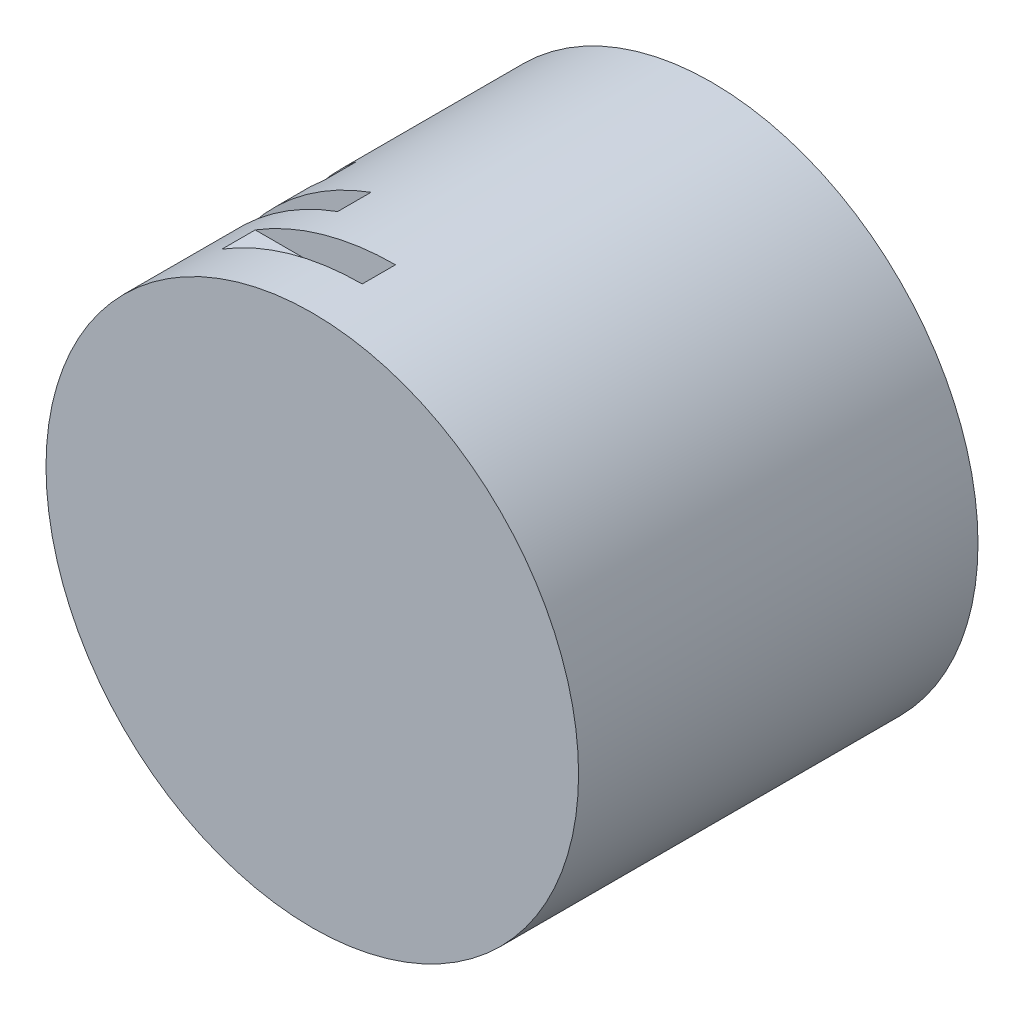
ISO-10303-21;
HEADER;
FILE_DESCRIPTION(('STEP AP214'),'2;1');
FILE_NAME('part.step','',(''),(''),'','','');
FILE_SCHEMA(('AUTOMOTIVE_DESIGN { 1 0 10303 214 1 1 1 1 }'));
ENDSEC;
DATA;
#1=APPLICATION_CONTEXT('core data for automotive mechanical design processes');
#2=APPLICATION_PROTOCOL_DEFINITION('international standard','automotive_design',2000,#1);
#3=PRODUCT_CONTEXT('',#1,'mechanical');
#4=PRODUCT('Part','Part','',(#3));
#5=PRODUCT_RELATED_PRODUCT_CATEGORY('part','',(#4));
#6=PRODUCT_DEFINITION_FORMATION('','',#4);
#7=PRODUCT_DEFINITION_CONTEXT('part definition',#1,'design');
#8=PRODUCT_DEFINITION('design','',#6,#7);
#9=PRODUCT_DEFINITION_SHAPE('','',#8);
#10=(LENGTH_UNIT() NAMED_UNIT(*) SI_UNIT(.MILLI.,.METRE.));
#11=(NAMED_UNIT(*) PLANE_ANGLE_UNIT() SI_UNIT($,.RADIAN.));
#12=(NAMED_UNIT(*) SI_UNIT($,.STERADIAN.) SOLID_ANGLE_UNIT());
#13=UNCERTAINTY_MEASURE_WITH_UNIT(LENGTH_MEASURE(1.E-05),#10,'distance_accuracy_value','');
#14=(GEOMETRIC_REPRESENTATION_CONTEXT(3) GLOBAL_UNCERTAINTY_ASSIGNED_CONTEXT((#13)) GLOBAL_UNIT_ASSIGNED_CONTEXT((#10,
#11,#12)) REPRESENTATION_CONTEXT('',''));
#15=CARTESIAN_POINT('',(0.,0.,0.));
#16=DIRECTION('',(0.,0.,1.));
#17=DIRECTION('',(1.,0.,0.));
#18=AXIS2_PLACEMENT_3D('',#15,#16,#17);
#19=CARTESIAN_POINT('',(0.,0.,300.));
#20=DIRECTION('',(0.,0.,-1.));
#21=DIRECTION('',(-1.,0.,0.));
#22=AXIS2_PLACEMENT_3D('',#19,#20,#21);
#23=CYLINDRICAL_SURFACE('',#22,400.);
#24=CARTESIAN_POINT('',(0.,0.,75.));
#25=DIRECTION('',(0.,0.,1.));
#26=DIRECTION('',(1.,0.,0.));
#27=AXIS2_PLACEMENT_3D('',#24,#25,#26);
#28=CIRCLE('',#27,400.);
#29=CARTESIAN_POINT('',(-136.808057330268,375.877048314363,75.));
#30=VERTEX_POINT('',#29);
#31=CARTESIAN_POINT('',(-314.292370464949,247.427374935602,75.));
#32=VERTEX_POINT('',#31);
#33=EDGE_CURVE('E134',#30,#32,#28,.T.);
#34=ORIENTED_EDGE('',*,*,#33,.F.);
#35=DIRECTION('',(0.,0.,1.));
#36=VECTOR('',#35,1.);
#37=CARTESIAN_POINT('',(-136.808057330268,375.877048314363,75.));
#38=LINE('',#37,#36);
#39=CARTESIAN_POINT('',(-136.808057330268,375.877048314363,125.));
#40=VERTEX_POINT('',#39);
#41=EDGE_CURVE('E151',#30,#40,#38,.T.);
#42=ORIENTED_EDGE('',*,*,#41,.T.);
#43=CARTESIAN_POINT('',(0.,0.,125.));
#44=DIRECTION('',(0.,0.,1.));
#45=DIRECTION('',(1.,0.,0.));
#46=AXIS2_PLACEMENT_3D('',#43,#44,#45);
#47=CIRCLE('',#46,400.);
#48=CARTESIAN_POINT('',(-314.292370464949,247.427374935602,125.));
#49=VERTEX_POINT('',#48);
#50=EDGE_CURVE('E145',#40,#49,#47,.T.);
#51=ORIENTED_EDGE('',*,*,#50,.T.);
#52=DIRECTION('',(0.,0.,1.));
#53=VECTOR('',#52,1.);
#54=CARTESIAN_POINT('',(-314.292370464949,247.427374935602,75.));
#55=LINE('',#54,#53);
#56=EDGE_CURVE('E144',#32,#49,#55,.T.);
#57=ORIENTED_EDGE('',*,*,#56,.F.);
#58=EDGE_LOOP('',(#34,#42,#51,#57));
#59=FACE_BOUND('',#58,.T.);
#60=CARTESIAN_POINT('',(0.,0.,-300.));
#61=DIRECTION('',(0.,0.,1.));
#62=DIRECTION('',(1.,0.,0.));
#63=AXIS2_PLACEMENT_3D('',#60,#61,#62);
#64=CIRCLE('',#63,400.);
#65=CARTESIAN_POINT('',(400.,0.,-300.));
#66=VERTEX_POINT('',#65);
#67=EDGE_CURVE('E40',#66,#66,#64,.T.);
#68=ORIENTED_EDGE('',*,*,#67,.T.);
#69=EDGE_LOOP('',(#68));
#70=FACE_BOUND('',#69,.T.);
#71=CARTESIAN_POINT('',(0.,0.,300.));
#72=DIRECTION('',(0.,0.,1.));
#73=DIRECTION('',(1.,0.,0.));
#74=AXIS2_PLACEMENT_3D('',#71,#72,#73);
#75=CIRCLE('',#74,400.);
#76=CARTESIAN_POINT('',(400.,0.,300.));
#77=VERTEX_POINT('',#76);
#78=EDGE_CURVE('E11',#77,#77,#75,.T.);
#79=ORIENTED_EDGE('',*,*,#78,.F.);
#80=EDGE_LOOP('',(#79));
#81=FACE_BOUND('',#80,.T.);
#82=CARTESIAN_POINT('',(0.,0.,175.));
#83=DIRECTION('',(0.,0.,1.));
#84=DIRECTION('',(1.,0.,0.));
#85=AXIS2_PLACEMENT_3D('',#82,#83,#84);
#86=CIRCLE('',#85,400.);
#87=CARTESIAN_POINT('',(0.,400.,175.));
#88=VERTEX_POINT('',#87);
#89=CARTESIAN_POINT('',(-210.713075057055,340.,175.));
#90=VERTEX_POINT('',#89);
#91=EDGE_CURVE('E158',#88,#90,#86,.T.);
#92=ORIENTED_EDGE('',*,*,#91,.F.);
#93=DIRECTION('',(0.,0.,1.));
#94=VECTOR('',#93,1.);
#95=CARTESIAN_POINT('',(0.,400.,175.));
#96=LINE('',#95,#94);
#97=CARTESIAN_POINT('',(0.,400.,225.));
#98=VERTEX_POINT('',#97);
#99=EDGE_CURVE('E176',#88,#98,#96,.T.);
#100=ORIENTED_EDGE('',*,*,#99,.T.);
#101=CARTESIAN_POINT('',(0.,0.,225.));
#102=DIRECTION('',(0.,0.,1.));
#103=DIRECTION('',(1.,0.,0.));
#104=AXIS2_PLACEMENT_3D('',#101,#102,#103);
#105=CIRCLE('',#104,400.);
#106=CARTESIAN_POINT('',(-210.713075057055,340.,225.));
#107=VERTEX_POINT('',#106);
#108=EDGE_CURVE('E154',#98,#107,#105,.T.);
#109=ORIENTED_EDGE('',*,*,#108,.T.);
#110=DIRECTION('',(0.,0.,1.));
#111=VECTOR('',#110,1.);
#112=CARTESIAN_POINT('',(-210.713075057055,340.,175.));
#113=LINE('',#112,#111);
#114=EDGE_CURVE('E168',#90,#107,#113,.T.);
#115=ORIENTED_EDGE('',*,*,#114,.F.);
#116=EDGE_LOOP('',(#92,#100,#109,#115));
#117=FACE_BOUND('',#116,.T.);
#118=CARTESIAN_POINT('',(0.,0.,-25.));
#119=DIRECTION('',(0.,0.,1.));
#120=DIRECTION('',(1.,0.,0.));
#121=AXIS2_PLACEMENT_3D('',#118,#119,#120);
#122=CIRCLE('',#121,400.);
#123=CARTESIAN_POINT('',(-257.115043874616,306.417777247591,-25.));
#124=VERTEX_POINT('',#123);
#125=CARTESIAN_POINT('',(-379.963367533393,125.011356814827,-25.));
#126=VERTEX_POINT('',#125);
#127=EDGE_CURVE('E119',#124,#126,#122,.T.);
#128=ORIENTED_EDGE('',*,*,#127,.F.);
#129=DIRECTION('',(0.,0.,1.));
#130=VECTOR('',#129,1.);
#131=CARTESIAN_POINT('',(-257.115043874616,306.417777247591,-25.));
#132=LINE('',#131,#130);
#133=CARTESIAN_POINT('',(-257.115043874616,306.417777247591,25.));
#134=VERTEX_POINT('',#133);
#135=EDGE_CURVE('E129',#124,#134,#132,.T.);
#136=ORIENTED_EDGE('',*,*,#135,.T.);
#137=CARTESIAN_POINT('',(0.,0.,25.));
#138=DIRECTION('',(0.,0.,1.));
#139=DIRECTION('',(1.,0.,0.));
#140=AXIS2_PLACEMENT_3D('',#137,#138,#139);
#141=CIRCLE('',#140,400.);
#142=CARTESIAN_POINT('',(-379.963367533393,125.011356814827,25.));
#143=VERTEX_POINT('',#142);
#144=EDGE_CURVE('E127',#134,#143,#141,.T.);
#145=ORIENTED_EDGE('',*,*,#144,.T.);
#146=DIRECTION('',(0.,0.,1.));
#147=VECTOR('',#146,1.);
#148=CARTESIAN_POINT('',(-379.963367533393,125.011356814827,-25.));
#149=LINE('',#148,#147);
#150=EDGE_CURVE('E112',#126,#143,#149,.T.);
#151=ORIENTED_EDGE('',*,*,#150,.F.);
#152=EDGE_LOOP('',(#128,#136,#145,#151));
#153=FACE_BOUND('',#152,.T.);
#154=ADVANCED_FACE('F37',(#59,#70,#81,#117,#153),#23,.T.);
#155=CARTESIAN_POINT('',(0.,0.,300.));
#156=DIRECTION('',(0.,0.,1.));
#157=DIRECTION('',(1.,0.,0.));
#158=AXIS2_PLACEMENT_3D('',#155,#156,#157);
#159=PLANE('',#158);
#160=ORIENTED_EDGE('',*,*,#78,.T.);
#161=EDGE_LOOP('',(#160));
#162=FACE_BOUND('',#161,.T.);
#163=ADVANCED_FACE('F206',(#162),#159,.T.);
#164=CARTESIAN_POINT('',(0.,0.,-300.));
#165=DIRECTION('',(0.,0.,1.));
#166=DIRECTION('',(1.,0.,0.));
#167=AXIS2_PLACEMENT_3D('',#164,#165,#166);
#168=PLANE('',#167);
#169=ORIENTED_EDGE('',*,*,#67,.F.);
#170=EDGE_LOOP('',(#169));
#171=FACE_BOUND('',#170,.T.);
#172=ADVANCED_FACE('F211',(#171),#168,.F.);
#173=CARTESIAN_POINT('',(0.,400.,175.));
#174=DIRECTION('',(1.,0.,0.));
#175=DIRECTION('',(0.,0.,-1.));
#176=AXIS2_PLACEMENT_3D('',#173,#174,#175);
#177=PLANE('',#176);
#178=DIRECTION('',(0.,1.,0.));
#179=VECTOR('',#178,1.);
#180=CARTESIAN_POINT('',(0.,400.,225.));
#181=LINE('',#180,#179);
#182=CARTESIAN_POINT('',(0.,340.,225.));
#183=VERTEX_POINT('',#182);
#184=EDGE_CURVE('E162',#183,#98,#181,.T.);
#185=ORIENTED_EDGE('',*,*,#184,.T.);
#186=ORIENTED_EDGE('',*,*,#99,.F.);
#187=DIRECTION('',(0.,1.,0.));
#188=VECTOR('',#187,1.);
#189=CARTESIAN_POINT('',(0.,400.,175.));
#190=LINE('',#189,#188);
#191=CARTESIAN_POINT('',(0.,340.,175.));
#192=VERTEX_POINT('',#191);
#193=EDGE_CURVE('E165',#192,#88,#190,.T.);
#194=ORIENTED_EDGE('',*,*,#193,.F.);
#195=DIRECTION('',(0.,0.,1.));
#196=VECTOR('',#195,1.);
#197=CARTESIAN_POINT('',(0.,340.,175.));
#198=LINE('',#197,#196);
#199=EDGE_CURVE('E179',#192,#183,#198,.T.);
#200=ORIENTED_EDGE('',*,*,#199,.T.);
#201=EDGE_LOOP('',(#185,#186,#194,#200));
#202=FACE_BOUND('',#201,.T.);
#203=ADVANCED_FACE('F191',(#202),#177,.F.);
#204=CARTESIAN_POINT('',(0.,340.,175.));
#205=DIRECTION('',(0.,-1.,0.));
#206=DIRECTION('',(1.,0.,0.));
#207=AXIS2_PLACEMENT_3D('',#204,#205,#206);
#208=PLANE('',#207);
#209=DIRECTION('',(1.,0.,0.));
#210=VECTOR('',#209,1.);
#211=CARTESIAN_POINT('',(0.,340.,225.));
#212=LINE('',#211,#210);
#213=EDGE_CURVE('E171',#107,#183,#212,.T.);
#214=ORIENTED_EDGE('',*,*,#213,.T.);
#215=ORIENTED_EDGE('',*,*,#199,.F.);
#216=DIRECTION('',(1.,0.,0.));
#217=VECTOR('',#216,1.);
#218=CARTESIAN_POINT('',(0.,340.,175.));
#219=LINE('',#218,#217);
#220=EDGE_CURVE('E161',#90,#192,#219,.T.);
#221=ORIENTED_EDGE('',*,*,#220,.F.);
#222=ORIENTED_EDGE('',*,*,#114,.T.);
#223=EDGE_LOOP('',(#214,#215,#221,#222));
#224=FACE_BOUND('',#223,.T.);
#225=ADVANCED_FACE('F184',(#224),#208,.F.);
#226=CARTESIAN_POINT('',(0.,0.,175.));
#227=DIRECTION('',(0.,0.,1.));
#228=DIRECTION('',(1.,0.,0.));
#229=AXIS2_PLACEMENT_3D('',#226,#227,#228);
#230=PLANE('',#229);
#231=ORIENTED_EDGE('',*,*,#91,.T.);
#232=ORIENTED_EDGE('',*,*,#220,.T.);
#233=ORIENTED_EDGE('',*,*,#193,.T.);
#234=EDGE_LOOP('',(#231,#232,#233));
#235=FACE_BOUND('',#234,.T.);
#236=ADVANCED_FACE('F194',(#235),#230,.T.);
#237=CARTESIAN_POINT('',(0.,0.,225.));
#238=DIRECTION('',(0.,0.,1.));
#239=DIRECTION('',(1.,0.,0.));
#240=AXIS2_PLACEMENT_3D('',#237,#238,#239);
#241=PLANE('',#240);
#242=ORIENTED_EDGE('',*,*,#108,.F.);
#243=ORIENTED_EDGE('',*,*,#184,.F.);
#244=ORIENTED_EDGE('',*,*,#213,.F.);
#245=EDGE_LOOP('',(#242,#243,#244));
#246=FACE_BOUND('',#245,.T.);
#247=ADVANCED_FACE('F189',(#246),#241,.F.);
#248=CARTESIAN_POINT('',(-136.808057330268,375.877048314363,75.));
#249=DIRECTION('',(0.939692620785908,0.342020143325669,0.));
#250=DIRECTION('',(-0.342020143325669,0.939692620785908,0.));
#251=AXIS2_PLACEMENT_3D('',#248,#249,#250);
#252=PLANE('',#251);
#253=DIRECTION('',(-0.342020143325669,0.939692620785908,0.));
#254=VECTOR('',#253,1.);
#255=CARTESIAN_POINT('',(-136.808057330268,375.877048314363,125.));
#256=LINE('',#255,#254);
#257=CARTESIAN_POINT('',(-116.286848730728,319.495491067209,125.));
#258=VERTEX_POINT('',#257);
#259=EDGE_CURVE('E138',#258,#40,#256,.T.);
#260=ORIENTED_EDGE('',*,*,#259,.T.);
#261=ORIENTED_EDGE('',*,*,#41,.F.);
#262=DIRECTION('',(-0.342020143325669,0.939692620785908,0.));
#263=VECTOR('',#262,1.);
#264=CARTESIAN_POINT('',(-136.808057330268,375.877048314363,75.));
#265=LINE('',#264,#263);
#266=CARTESIAN_POINT('',(-116.286848730728,319.495491067209,75.));
#267=VERTEX_POINT('',#266);
#268=EDGE_CURVE('E141',#267,#30,#265,.T.);
#269=ORIENTED_EDGE('',*,*,#268,.F.);
#270=DIRECTION('',(0.,0.,1.));
#271=VECTOR('',#270,1.);
#272=CARTESIAN_POINT('',(-116.286848730728,319.495491067209,75.));
#273=LINE('',#272,#271);
#274=EDGE_CURVE('E155',#267,#258,#273,.T.);
#275=ORIENTED_EDGE('',*,*,#274,.T.);
#276=EDGE_LOOP('',(#260,#261,#269,#275));
#277=FACE_BOUND('',#276,.T.);
#278=ADVANCED_FACE('F201',(#277),#252,.F.);
#279=CARTESIAN_POINT('',(-116.286848730728,319.495491067209,75.));
#280=DIRECTION('',(0.34202014332567,-0.939692620785908,0.));
#281=DIRECTION('',(0.939692620785908,0.34202014332567,0.));
#282=AXIS2_PLACEMENT_3D('',#279,#280,#281);
#283=PLANE('',#282);
#284=DIRECTION('',(0.939692620785908,0.34202014332567,0.));
#285=VECTOR('',#284,1.);
#286=CARTESIAN_POINT('',(-116.286848730728,319.495491067209,125.));
#287=LINE('',#286,#285);
#288=EDGE_CURVE('E59',#49,#258,#287,.T.);
#289=ORIENTED_EDGE('',*,*,#288,.T.);
#290=ORIENTED_EDGE('',*,*,#274,.F.);
#291=DIRECTION('',(0.939692620785908,0.34202014332567,0.));
#292=VECTOR('',#291,1.);
#293=CARTESIAN_POINT('',(-116.286848730728,319.495491067209,75.));
#294=LINE('',#293,#292);
#295=EDGE_CURVE('E137',#32,#267,#294,.T.);
#296=ORIENTED_EDGE('',*,*,#295,.F.);
#297=ORIENTED_EDGE('',*,*,#56,.T.);
#298=EDGE_LOOP('',(#289,#290,#296,#297));
#299=FACE_BOUND('',#298,.T.);
#300=ADVANCED_FACE('F252',(#299),#283,.F.);
#301=CARTESIAN_POINT('',(0.,0.,75.));
#302=DIRECTION('',(0.,0.,1.));
#303=DIRECTION('',(1.,0.,0.));
#304=AXIS2_PLACEMENT_3D('',#301,#302,#303);
#305=PLANE('',#304);
#306=ORIENTED_EDGE('',*,*,#33,.T.);
#307=ORIENTED_EDGE('',*,*,#295,.T.);
#308=ORIENTED_EDGE('',*,*,#268,.T.);
#309=EDGE_LOOP('',(#306,#307,#308));
#310=FACE_BOUND('',#309,.T.);
#311=ADVANCED_FACE('F262',(#310),#305,.T.);
#312=CARTESIAN_POINT('',(0.,0.,125.));
#313=DIRECTION('',(0.,0.,1.));
#314=DIRECTION('',(1.,0.,0.));
#315=AXIS2_PLACEMENT_3D('',#312,#313,#314);
#316=PLANE('',#315);
#317=ORIENTED_EDGE('',*,*,#50,.F.);
#318=ORIENTED_EDGE('',*,*,#259,.F.);
#319=ORIENTED_EDGE('',*,*,#288,.F.);
#320=EDGE_LOOP('',(#317,#318,#319));
#321=FACE_BOUND('',#320,.T.);
#322=ADVANCED_FACE('F271',(#321),#316,.F.);
#323=CARTESIAN_POINT('',(-257.115043874616,306.417777247591,-25.));
#324=DIRECTION('',(0.766044443118977,0.642787609686541,0.));
#325=DIRECTION('',(-0.642787609686541,0.766044443118977,0.));
#326=AXIS2_PLACEMENT_3D('',#323,#324,#325);
#327=PLANE('',#326);
#328=DIRECTION('',(-0.642787609686541,0.766044443118977,0.));
#329=VECTOR('',#328,1.);
#330=CARTESIAN_POINT('',(-257.115043874616,306.417777247591,25.));
#331=LINE('',#330,#329);
#332=CARTESIAN_POINT('',(-218.547787293424,260.455110660452,25.));
#333=VERTEX_POINT('',#332);
#334=EDGE_CURVE('E125',#333,#134,#331,.T.);
#335=ORIENTED_EDGE('',*,*,#334,.T.);
#336=ORIENTED_EDGE('',*,*,#135,.F.);
#337=DIRECTION('',(-0.642787609686541,0.766044443118977,0.));
#338=VECTOR('',#337,1.);
#339=CARTESIAN_POINT('',(-257.115043874616,306.417777247591,-25.));
#340=LINE('',#339,#338);
#341=CARTESIAN_POINT('',(-218.547787293424,260.455110660452,-25.));
#342=VERTEX_POINT('',#341);
#343=EDGE_CURVE('E118',#342,#124,#340,.T.);
#344=ORIENTED_EDGE('',*,*,#343,.F.);
#345=DIRECTION('',(0.,0.,1.));
#346=VECTOR('',#345,1.);
#347=CARTESIAN_POINT('',(-218.547787293424,260.455110660452,-25.));
#348=LINE('',#347,#346);
#349=EDGE_CURVE('E114',#342,#333,#348,.T.);
#350=ORIENTED_EDGE('',*,*,#349,.T.);
#351=EDGE_LOOP('',(#335,#336,#344,#350));
#352=FACE_BOUND('',#351,.T.);
#353=ADVANCED_FACE('F280',(#352),#327,.F.);
#354=CARTESIAN_POINT('',(-218.547787293424,260.455110660452,-25.));
#355=DIRECTION('',(0.642787609686541,-0.766044443118977,0.));
#356=DIRECTION('',(0.766044443118977,0.642787609686541,0.));
#357=AXIS2_PLACEMENT_3D('',#354,#355,#356);
#358=PLANE('',#357);
#359=DIRECTION('',(0.766044443118977,0.642787609686541,0.));
#360=VECTOR('',#359,1.);
#361=CARTESIAN_POINT('',(-218.547787293424,260.455110660452,25.));
#362=LINE('',#361,#360);
#363=EDGE_CURVE('E51',#143,#333,#362,.T.);
#364=ORIENTED_EDGE('',*,*,#363,.T.);
#365=ORIENTED_EDGE('',*,*,#349,.F.);
#366=DIRECTION('',(0.766044443118977,0.642787609686541,0.));
#367=VECTOR('',#366,1.);
#368=CARTESIAN_POINT('',(-218.547787293424,260.455110660452,-25.));
#369=LINE('',#368,#367);
#370=EDGE_CURVE('E108',#126,#342,#369,.T.);
#371=ORIENTED_EDGE('',*,*,#370,.F.);
#372=ORIENTED_EDGE('',*,*,#150,.T.);
#373=EDGE_LOOP('',(#364,#365,#371,#372));
#374=FACE_BOUND('',#373,.T.);
#375=ADVANCED_FACE('F110',(#374),#358,.F.);
#376=CARTESIAN_POINT('',(0.,0.,-25.));
#377=DIRECTION('',(0.,0.,1.));
#378=DIRECTION('',(1.,0.,0.));
#379=AXIS2_PLACEMENT_3D('',#376,#377,#378);
#380=PLANE('',#379);
#381=ORIENTED_EDGE('',*,*,#127,.T.);
#382=ORIENTED_EDGE('',*,*,#370,.T.);
#383=ORIENTED_EDGE('',*,*,#343,.T.);
#384=EDGE_LOOP('',(#381,#382,#383));
#385=FACE_BOUND('',#384,.T.);
#386=ADVANCED_FACE('F122',(#385),#380,.T.);
#387=CARTESIAN_POINT('',(0.,0.,25.));
#388=DIRECTION('',(0.,0.,1.));
#389=DIRECTION('',(1.,0.,0.));
#390=AXIS2_PLACEMENT_3D('',#387,#388,#389);
#391=PLANE('',#390);
#392=ORIENTED_EDGE('',*,*,#144,.F.);
#393=ORIENTED_EDGE('',*,*,#334,.F.);
#394=ORIENTED_EDGE('',*,*,#363,.F.);
#395=EDGE_LOOP('',(#392,#393,#394));
#396=FACE_BOUND('',#395,.T.);
#397=ADVANCED_FACE('F311',(#396),#391,.F.);
#398=CLOSED_SHELL('',(#154,#163,#172,#203,#225,#236,#247,#278,#300,#311,#322,#353,#375,#386,#397));
#399=MANIFOLD_SOLID_BREP('B2',#398);
#400=ADVANCED_BREP_SHAPE_REPRESENTATION('',(#18,#399),#14);
#401=SHAPE_DEFINITION_REPRESENTATION(#9,#400);
ENDSEC;
END-ISO-10303-21;
